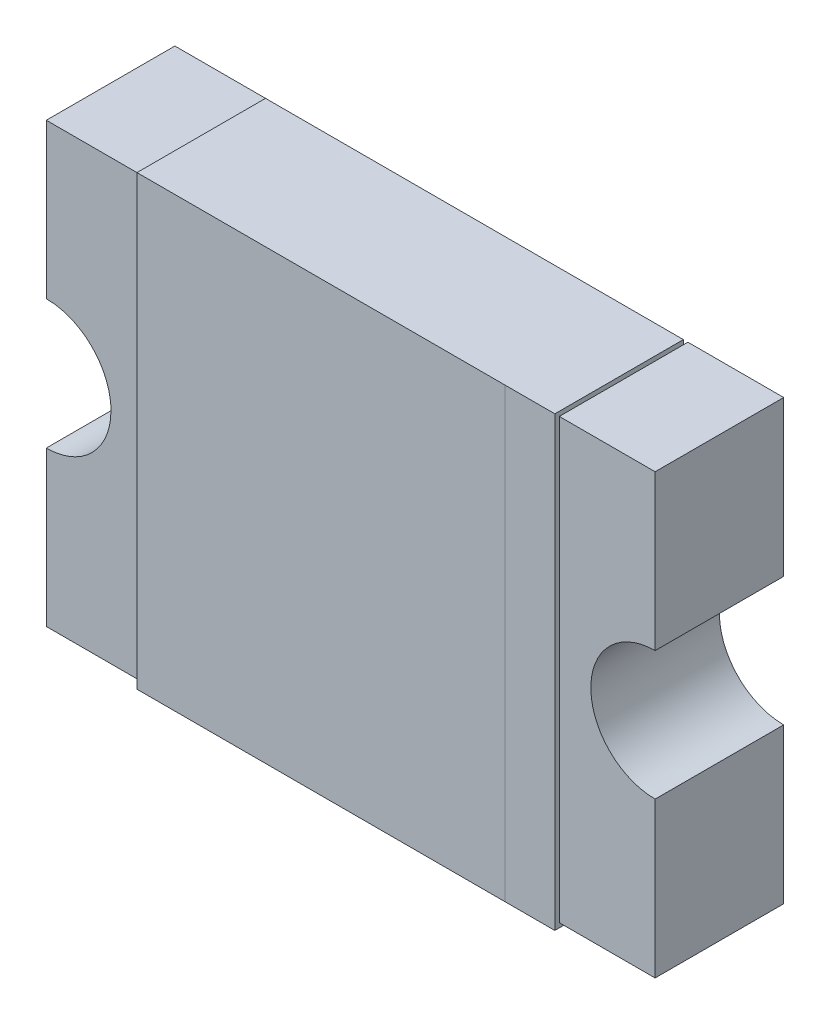
ISO-10303-21;
HEADER;
FILE_DESCRIPTION(('STEP AP214'),'2;1');
FILE_NAME('part.step','',(''),(''),'','','');
FILE_SCHEMA(('AUTOMOTIVE_DESIGN { 1 0 10303 214 1 1 1 1 }'));
ENDSEC;
DATA;
#1=APPLICATION_CONTEXT('core data for automotive mechanical design processes');
#2=APPLICATION_PROTOCOL_DEFINITION('international standard','automotive_design',2000,#1);
#3=PRODUCT_CONTEXT('',#1,'mechanical');
#4=PRODUCT('Part','Part','',(#3));
#5=PRODUCT_RELATED_PRODUCT_CATEGORY('part','',(#4));
#6=PRODUCT_DEFINITION_FORMATION('','',#4);
#7=PRODUCT_DEFINITION_CONTEXT('part definition',#1,'design');
#8=PRODUCT_DEFINITION('design','',#6,#7);
#9=PRODUCT_DEFINITION_SHAPE('','',#8);
#10=(LENGTH_UNIT() NAMED_UNIT(*) SI_UNIT(.MILLI.,.METRE.));
#11=(NAMED_UNIT(*) PLANE_ANGLE_UNIT() SI_UNIT($,.RADIAN.));
#12=(NAMED_UNIT(*) SI_UNIT($,.STERADIAN.) SOLID_ANGLE_UNIT());
#13=UNCERTAINTY_MEASURE_WITH_UNIT(LENGTH_MEASURE(1.E-05),#10,'distance_accuracy_value','');
#14=(GEOMETRIC_REPRESENTATION_CONTEXT(3) GLOBAL_UNCERTAINTY_ASSIGNED_CONTEXT((#13)) GLOBAL_UNIT_ASSIGNED_CONTEXT((#10,
#11,#12)) REPRESENTATION_CONTEXT('',''));
#15=CARTESIAN_POINT('',(0.,0.,0.));
#16=DIRECTION('',(0.,0.,1.));
#17=DIRECTION('',(1.,0.,0.));
#18=AXIS2_PLACEMENT_3D('',#15,#16,#17);
#19=CARTESIAN_POINT('',(-2.365,-1.705,1.));
#20=DIRECTION('',(0.,0.,1.));
#21=DIRECTION('',(1.,0.,0.));
#22=AXIS2_PLACEMENT_3D('',#19,#20,#21);
#23=PLANE('',#22);
#24=DIRECTION('',(0.,1.,0.));
#25=VECTOR('',#24,1.);
#26=CARTESIAN_POINT('',(2.37,-1.705,1.));
#27=LINE('',#26,#25);
#28=CARTESIAN_POINT('',(2.37,0.499999999999999,1.));
#29=VERTEX_POINT('',#28);
#30=CARTESIAN_POINT('',(2.37,1.705,1.));
#31=VERTEX_POINT('',#30);
#32=EDGE_CURVE('E161',#29,#31,#27,.T.);
#33=ORIENTED_EDGE('',*,*,#32,.T.);
#34=DIRECTION('',(1.,0.,0.));
#35=VECTOR('',#34,1.);
#36=CARTESIAN_POINT('',(-2.365,1.705,1.));
#37=LINE('',#36,#35);
#38=CARTESIAN_POINT('',(1.625,1.705,1.));
#39=VERTEX_POINT('',#38);
#40=EDGE_CURVE('E158',#31,#39,#37,.F.);
#41=ORIENTED_EDGE('',*,*,#40,.T.);
#42=DIRECTION('',(0.,-1.,0.));
#43=VECTOR('',#42,1.);
#44=CARTESIAN_POINT('',(1.625,1.705,1.));
#45=LINE('',#44,#43);
#46=CARTESIAN_POINT('',(1.625,-1.705,1.));
#47=VERTEX_POINT('',#46);
#48=EDGE_CURVE('E150',#39,#47,#45,.T.);
#49=ORIENTED_EDGE('',*,*,#48,.T.);
#50=DIRECTION('',(1.,0.,0.));
#51=VECTOR('',#50,1.);
#52=CARTESIAN_POINT('',(-2.365,-1.705,1.));
#53=LINE('',#52,#51);
#54=CARTESIAN_POINT('',(2.37,-1.705,1.));
#55=VERTEX_POINT('',#54);
#56=EDGE_CURVE('E134',#47,#55,#53,.T.);
#57=ORIENTED_EDGE('',*,*,#56,.T.);
#58=DIRECTION('',(0.,1.,0.));
#59=VECTOR('',#58,1.);
#60=CARTESIAN_POINT('',(2.37,-1.705,1.));
#61=LINE('',#60,#59);
#62=CARTESIAN_POINT('',(2.37,-0.500000000000001,1.));
#63=VERTEX_POINT('',#62);
#64=EDGE_CURVE('E123',#55,#63,#61,.T.);
#65=ORIENTED_EDGE('',*,*,#64,.T.);
#66=CARTESIAN_POINT('',(2.37,-0.500000000000001,1.));
#67=CARTESIAN_POINT('',(2.27438228657088,-0.499797074817794,1.));
#68=CARTESIAN_POINT('',(2.18595264521906,-0.464894150531217,1.));
#69=CARTESIAN_POINT('',(2.09012168443612,-0.427069946820945,1.));
#70=CARTESIAN_POINT('',(2.01644660940673,-0.353553390593275,1.));
#71=CARTESIAN_POINT('',(1.94351752679599,-0.280781221711928,1.));
#72=CARTESIAN_POINT('',(1.90510584946879,-0.184047354780938,1.));
#73=CARTESIAN_POINT('',(1.87010175667304,-0.0958949623274634,1.));
#74=CARTESIAN_POINT('',(1.87,0.,1.));
#75=CARTESIAN_POINT('',(1.86989935366217,0.0948485881711915,1.));
#76=CARTESIAN_POINT('',(1.90510584946879,0.184047354780935,1.));
#77=CARTESIAN_POINT('',(1.94293005317902,0.279878315563891,1.));
#78=CARTESIAN_POINT('',(2.01644660940673,0.353553390593272,1.));
#79=CARTESIAN_POINT('',(2.08921877828823,0.426482473204124,1.));
#80=CARTESIAN_POINT('',(2.18595264521906,0.464894150531214,1.));
#81=CARTESIAN_POINT('',(2.27384740170316,0.499795939655639,1.));
#82=CARTESIAN_POINT('',(2.37,0.499999999999999,1.));
#83=B_SPLINE_CURVE_WITH_KNOTS('',2,(#66,#67,#68,#69,#70,#71,#72,#73,#74,#75,#76,#77,#78,#79,#80,
#81,#82),.UNSPECIFIED.,.F.,.F.,(3,2,2,2,2,2,2,2,3),(0.,0.125,0.25,0.375,0.5,0.625,0.75,0.875,
1.),.UNSPECIFIED.);
#84=EDGE_CURVE('E133',#63,#29,#83,.T.);
#85=ORIENTED_EDGE('',*,*,#84,.T.);
#86=EDGE_LOOP('',(#33,#41,#49,#57,#65,#85));
#87=FACE_BOUND('',#86,.T.);
#88=ADVANCED_FACE('F17',(#87),#23,.T.);
#89=CARTESIAN_POINT('',(-2.365,-1.705,1.));
#90=DIRECTION('',(0.,0.,1.));
#91=DIRECTION('',(1.,0.,0.));
#92=AXIS2_PLACEMENT_3D('',#89,#90,#91);
#93=PLANE('',#92);
#94=DIRECTION('',(0.,1.,0.));
#95=VECTOR('',#94,1.);
#96=CARTESIAN_POINT('',(-2.365,1.705,1.));
#97=LINE('',#96,#95);
#98=CARTESIAN_POINT('',(-2.365,-0.502851750543757,1.));
#99=VERTEX_POINT('',#98);
#100=CARTESIAN_POINT('',(-2.365,-1.705,1.));
#101=VERTEX_POINT('',#100);
#102=EDGE_CURVE('E224',#99,#101,#97,.F.);
#103=ORIENTED_EDGE('',*,*,#102,.T.);
#104=DIRECTION('',(1.,0.,0.));
#105=VECTOR('',#104,1.);
#106=CARTESIAN_POINT('',(-2.365,-1.705,1.));
#107=LINE('',#106,#105);
#108=CARTESIAN_POINT('',(-1.625,-1.705,1.));
#109=VERTEX_POINT('',#108);
#110=EDGE_CURVE('E521',#101,#109,#107,.T.);
#111=ORIENTED_EDGE('',*,*,#110,.T.);
#112=DIRECTION('',(0.,1.,0.));
#113=VECTOR('',#112,1.);
#114=CARTESIAN_POINT('',(-1.625,1.705,1.));
#115=LINE('',#114,#113);
#116=CARTESIAN_POINT('',(-1.625,1.705,1.));
#117=VERTEX_POINT('',#116);
#118=EDGE_CURVE('E176',#109,#117,#115,.T.);
#119=ORIENTED_EDGE('',*,*,#118,.T.);
#120=DIRECTION('',(1.,0.,0.));
#121=VECTOR('',#120,1.);
#122=CARTESIAN_POINT('',(-2.365,1.705,1.));
#123=LINE('',#122,#121);
#124=CARTESIAN_POINT('',(-2.365,1.705,1.));
#125=VERTEX_POINT('',#124);
#126=EDGE_CURVE('E160',#117,#125,#123,.F.);
#127=ORIENTED_EDGE('',*,*,#126,.T.);
#128=DIRECTION('',(0.,1.,0.));
#129=VECTOR('',#128,1.);
#130=CARTESIAN_POINT('',(-2.365,1.705,1.));
#131=LINE('',#130,#129);
#132=CARTESIAN_POINT('',(-2.365,0.502851750543758,1.));
#133=VERTEX_POINT('',#132);
#134=EDGE_CURVE('E453',#125,#133,#131,.F.);
#135=ORIENTED_EDGE('',*,*,#134,.T.);
#136=CARTESIAN_POINT('',(-2.365,0.502851750543758,1.));
#137=CARTESIAN_POINT('',(-2.26883834751611,0.502648828859451,1.));
#138=CARTESIAN_POINT('',(-2.17990293093092,0.46754567482435,1.));
#139=CARTESIAN_POINT('',(-2.08352281969069,0.429504070920183,1.));
#140=CARTESIAN_POINT('',(-2.00943011725898,0.355569882741018,1.));
#141=CARTESIAN_POINT('',(-1.93608340269938,0.282380086464229,1.));
#142=CARTESIAN_POINT('',(-1.89745432517565,0.185097069069084,1.));
#143=CARTESIAN_POINT('',(-1.86235229986514,0.0966965387486382,1.));
#144=CARTESIAN_POINT('',(-1.86214824945624,0.,1.));
#145=B_SPLINE_CURVE_WITH_KNOTS('',2,(#136,#137,#138,#139,#140,#141,#142,#143,#144),
.UNSPECIFIED.,.F.,.F.,(3,2,2,2,3),(0.,0.25,0.5,0.75,1.),.UNSPECIFIED.);
#146=CARTESIAN_POINT('',(-1.86214824945624,0.,1.));
#147=VERTEX_POINT('',#146);
#148=EDGE_CURVE('E502',#133,#147,#145,.T.);
#149=ORIENTED_EDGE('',*,*,#148,.T.);
#150=CARTESIAN_POINT('',(-1.86214824945624,0.,1.));
#151=CARTESIAN_POINT('',(-1.86235117114055,-0.0961616524839028,1.));
#152=CARTESIAN_POINT('',(-1.89745432517565,-0.185097069069084,1.));
#153=CARTESIAN_POINT('',(-1.93549592907983,-0.281477180309321,1.));
#154=CARTESIAN_POINT('',(-2.00943011725898,-0.355569882741017,1.));
#155=CARTESIAN_POINT('',(-2.08261991353579,-0.428916597300633,1.));
#156=CARTESIAN_POINT('',(-2.17990293093092,-0.467545674824349,1.));
#157=CARTESIAN_POINT('',(-2.26830346125138,-0.502647700134861,1.));
#158=CARTESIAN_POINT('',(-2.365,-0.502851750543758,1.));
#159=B_SPLINE_CURVE_WITH_KNOTS('',2,(#150,#151,#152,#153,#154,#155,#156,#157,#158),
.UNSPECIFIED.,.F.,.F.,(3,2,2,2,3),(0.,0.25,0.5,0.75,1.),.UNSPECIFIED.);
#160=EDGE_CURVE('E237',#147,#99,#159,.T.);
#161=ORIENTED_EDGE('',*,*,#160,.T.);
#162=EDGE_LOOP('',(#103,#111,#119,#127,#135,#149,#161));
#163=FACE_BOUND('',#162,.T.);
#164=ADVANCED_FACE('F508',(#163),#93,.T.);
#165=CARTESIAN_POINT('',(1.625,1.705,1.035));
#166=DIRECTION('',(-1.,0.,0.));
#167=DIRECTION('',(0.,-1.,0.));
#168=AXIS2_PLACEMENT_3D('',#165,#166,#167);
#169=PLANE('',#168);
#170=DIRECTION('',(0.,1.,0.));
#171=VECTOR('',#170,1.);
#172=CARTESIAN_POINT('',(1.625,-1.74,1.0349));
#173=LINE('',#172,#171);
#174=CARTESIAN_POINT('',(1.625,1.74,1.0349));
#175=VERTEX_POINT('',#174);
#176=CARTESIAN_POINT('',(1.625,-1.74,1.0349));
#177=VERTEX_POINT('',#176);
#178=EDGE_CURVE('E242',#175,#177,#173,.F.);
#179=ORIENTED_EDGE('',*,*,#178,.T.);
#180=DIRECTION('',(0.,0.,1.));
#181=VECTOR('',#180,1.);
#182=CARTESIAN_POINT('',(1.625,-1.74,1.035));
#183=LINE('',#182,#181);
#184=CARTESIAN_POINT('',(1.625,-1.74,0.0350000000000001));
#185=VERTEX_POINT('',#184);
#186=EDGE_CURVE('E463',#185,#177,#183,.T.);
#187=ORIENTED_EDGE('',*,*,#186,.F.);
#188=DIRECTION('',(0.,-1.,0.));
#189=VECTOR('',#188,1.);
#190=CARTESIAN_POINT('',(1.625,1.705,0.0350000000000001));
#191=LINE('',#190,#189);
#192=CARTESIAN_POINT('',(1.625,-1.705,0.0350000000000001));
#193=VERTEX_POINT('',#192);
#194=EDGE_CURVE('E471',#193,#185,#191,.T.);
#195=ORIENTED_EDGE('',*,*,#194,.F.);
#196=DIRECTION('',(0.,0.,1.));
#197=VECTOR('',#196,1.);
#198=CARTESIAN_POINT('',(1.625,-1.705,1.035));
#199=LINE('',#198,#197);
#200=EDGE_CURVE('E598',#47,#193,#199,.F.);
#201=ORIENTED_EDGE('',*,*,#200,.F.);
#202=ORIENTED_EDGE('',*,*,#48,.F.);
#203=DIRECTION('',(0.,0.,1.));
#204=VECTOR('',#203,1.);
#205=CARTESIAN_POINT('',(1.625,1.705,1.035));
#206=LINE('',#205,#204);
#207=CARTESIAN_POINT('',(1.625,1.705,0.0349999999999999));
#208=VERTEX_POINT('',#207);
#209=EDGE_CURVE('E164',#208,#39,#206,.T.);
#210=ORIENTED_EDGE('',*,*,#209,.F.);
#211=DIRECTION('',(0.,-1.,0.));
#212=VECTOR('',#211,1.);
#213=CARTESIAN_POINT('',(1.625,1.705,0.0349999999999999));
#214=LINE('',#213,#212);
#215=CARTESIAN_POINT('',(1.625,1.74,0.0349999999999999));
#216=VERTEX_POINT('',#215);
#217=EDGE_CURVE('E166',#216,#208,#214,.T.);
#218=ORIENTED_EDGE('',*,*,#217,.F.);
#219=DIRECTION('',(0.,0.,1.));
#220=VECTOR('',#219,1.);
#221=CARTESIAN_POINT('',(1.625,1.74,1.035));
#222=LINE('',#221,#220);
#223=EDGE_CURVE('E455',#175,#216,#222,.F.);
#224=ORIENTED_EDGE('',*,*,#223,.F.);
#225=EDGE_LOOP('',(#179,#187,#195,#201,#202,#210,#218,#224));
#226=FACE_BOUND('',#225,.T.);
#227=ADVANCED_FACE('F516',(#226),#169,.F.);
#228=CARTESIAN_POINT('',(-2.365,1.705,1.));
#229=DIRECTION('',(1.,0.,0.));
#230=DIRECTION('',(0.,1.,0.));
#231=AXIS2_PLACEMENT_3D('',#228,#229,#230);
#232=PLANE('',#231);
#233=DIRECTION('',(0.,0.,1.));
#234=VECTOR('',#233,1.);
#235=CARTESIAN_POINT('',(-2.365,0.502851750543758,0.));
#236=LINE('',#235,#234);
#237=CARTESIAN_POINT('',(-2.365,0.502851750543758,0.));
#238=VERTEX_POINT('',#237);
#239=EDGE_CURVE('E259',#238,#133,#236,.T.);
#240=ORIENTED_EDGE('',*,*,#239,.T.);
#241=ORIENTED_EDGE('',*,*,#134,.F.);
#242=DIRECTION('',(0.,0.,-1.));
#243=VECTOR('',#242,1.);
#244=CARTESIAN_POINT('',(-2.365,1.705,1.));
#245=LINE('',#244,#243);
#246=CARTESIAN_POINT('',(-2.365,1.705,0.));
#247=VERTEX_POINT('',#246);
#248=EDGE_CURVE('E438',#125,#247,#245,.T.);
#249=ORIENTED_EDGE('',*,*,#248,.T.);
#250=DIRECTION('',(0.,1.,0.));
#251=VECTOR('',#250,1.);
#252=CARTESIAN_POINT('',(-2.365,-1.705,0.));
#253=LINE('',#252,#251);
#254=EDGE_CURVE('E295',#247,#238,#253,.F.);
#255=ORIENTED_EDGE('',*,*,#254,.T.);
#256=EDGE_LOOP('',(#240,#241,#249,#255));
#257=FACE_BOUND('',#256,.T.);
#258=ADVANCED_FACE('F271',(#257),#232,.F.);
#259=CARTESIAN_POINT('',(-2.365,0.,0.));
#260=DIRECTION('',(0.,0.,1.));
#261=DIRECTION('',(1.,0.,0.));
#262=AXIS2_PLACEMENT_3D('',#259,#260,#261);
#263=CYLINDRICAL_SURFACE('',#262,0.502851750543758);
#264=CARTESIAN_POINT('',(-2.365,0.,0.));
#265=DIRECTION('',(0.,0.,-1.));
#266=DIRECTION('',(1.,0.,0.));
#267=AXIS2_PLACEMENT_3D('',#264,#265,#266);
#268=CIRCLE('',#267,0.502851750543758);
#269=CARTESIAN_POINT('',(-1.86214824945624,0.,0.));
#270=VERTEX_POINT('',#269);
#271=CARTESIAN_POINT('',(-2.365,-0.502851750543757,0.));
#272=VERTEX_POINT('',#271);
#273=EDGE_CURVE('E254',#270,#272,#268,.T.);
#274=ORIENTED_EDGE('',*,*,#273,.T.);
#275=DIRECTION('',(0.,0.,1.));
#276=VECTOR('',#275,1.);
#277=CARTESIAN_POINT('',(-2.365,-0.502851750543756,1.));
#278=LINE('',#277,#276);
#279=EDGE_CURVE('E234',#272,#99,#278,.T.);
#280=ORIENTED_EDGE('',*,*,#279,.T.);
#281=ORIENTED_EDGE('',*,*,#160,.F.);
#282=ORIENTED_EDGE('',*,*,#148,.F.);
#283=ORIENTED_EDGE('',*,*,#239,.F.);
#284=CARTESIAN_POINT('',(-2.365,0.,0.));
#285=DIRECTION('',(0.,0.,-1.));
#286=DIRECTION('',(0.,1.,0.));
#287=AXIS2_PLACEMENT_3D('',#284,#285,#286);
#288=CIRCLE('',#287,0.502851750543758);
#289=EDGE_CURVE('E290',#238,#270,#288,.T.);
#290=ORIENTED_EDGE('',*,*,#289,.T.);
#291=EDGE_LOOP('',(#274,#280,#281,#282,#283,#290));
#292=FACE_BOUND('',#291,.T.);
#293=ADVANCED_FACE('F261',(#292),#263,.F.);
#294=CARTESIAN_POINT('',(-2.365,1.705,1.));
#295=DIRECTION('',(1.,0.,0.));
#296=DIRECTION('',(0.,1.,0.));
#297=AXIS2_PLACEMENT_3D('',#294,#295,#296);
#298=PLANE('',#297);
#299=ORIENTED_EDGE('',*,*,#279,.F.);
#300=DIRECTION('',(0.,1.,0.));
#301=VECTOR('',#300,1.);
#302=CARTESIAN_POINT('',(-2.365,-1.705,0.));
#303=LINE('',#302,#301);
#304=CARTESIAN_POINT('',(-2.365,-1.705,0.));
#305=VERTEX_POINT('',#304);
#306=EDGE_CURVE('E248',#272,#305,#303,.F.);
#307=ORIENTED_EDGE('',*,*,#306,.T.);
#308=DIRECTION('',(0.,0.,1.));
#309=VECTOR('',#308,1.);
#310=CARTESIAN_POINT('',(-2.365,-1.705,1.));
#311=LINE('',#310,#309);
#312=EDGE_CURVE('E186',#305,#101,#311,.T.);
#313=ORIENTED_EDGE('',*,*,#312,.T.);
#314=ORIENTED_EDGE('',*,*,#102,.F.);
#315=EDGE_LOOP('',(#299,#307,#313,#314));
#316=FACE_BOUND('',#315,.T.);
#317=ADVANCED_FACE('F270',(#316),#298,.F.);
#318=CARTESIAN_POINT('',(2.37,1.705,1.));
#319=DIRECTION('',(-1.,0.,0.));
#320=DIRECTION('',(0.,-1.,0.));
#321=AXIS2_PLACEMENT_3D('',#318,#319,#320);
#322=PLANE('',#321);
#323=ORIENTED_EDGE('',*,*,#64,.F.);
#324=DIRECTION('',(0.,0.,1.));
#325=VECTOR('',#324,1.);
#326=CARTESIAN_POINT('',(2.37,-1.705,1.));
#327=LINE('',#326,#325);
#328=CARTESIAN_POINT('',(2.37,-1.705,0.));
#329=VERTEX_POINT('',#328);
#330=EDGE_CURVE('E126',#55,#329,#327,.F.);
#331=ORIENTED_EDGE('',*,*,#330,.T.);
#332=DIRECTION('',(0.,1.,0.));
#333=VECTOR('',#332,1.);
#334=CARTESIAN_POINT('',(2.37,-1.705,0.));
#335=LINE('',#334,#333);
#336=CARTESIAN_POINT('',(2.37,-0.500000000000001,0.));
#337=VERTEX_POINT('',#336);
#338=EDGE_CURVE('E144',#329,#337,#335,.T.);
#339=ORIENTED_EDGE('',*,*,#338,.T.);
#340=DIRECTION('',(0.,0.,1.));
#341=VECTOR('',#340,1.);
#342=CARTESIAN_POINT('',(2.37,-0.500000000000001,0.));
#343=LINE('',#342,#341);
#344=EDGE_CURVE('E129',#337,#63,#343,.T.);
#345=ORIENTED_EDGE('',*,*,#344,.T.);
#346=EDGE_LOOP('',(#323,#331,#339,#345));
#347=FACE_BOUND('',#346,.T.);
#348=ADVANCED_FACE('F125',(#347),#322,.F.);
#349=CARTESIAN_POINT('',(2.37,0.,0.));
#350=DIRECTION('',(0.,0.,1.));
#351=DIRECTION('',(0.,-1.,0.));
#352=AXIS2_PLACEMENT_3D('',#349,#350,#351);
#353=CYLINDRICAL_SURFACE('',#352,0.5);
#354=CARTESIAN_POINT('',(2.37,0.,0.));
#355=DIRECTION('',(0.,0.,-1.));
#356=DIRECTION('',(0.,-1.,0.));
#357=AXIS2_PLACEMENT_3D('',#354,#355,#356);
#358=CIRCLE('',#357,0.5);
#359=CARTESIAN_POINT('',(2.37,0.499999999999999,0.));
#360=VERTEX_POINT('',#359);
#361=EDGE_CURVE('E398',#337,#360,#358,.T.);
#362=ORIENTED_EDGE('',*,*,#361,.T.);
#363=DIRECTION('',(0.,0.,1.));
#364=VECTOR('',#363,1.);
#365=CARTESIAN_POINT('',(2.37,0.499999999999999,1.));
#366=LINE('',#365,#364);
#367=EDGE_CURVE('E179',#360,#29,#366,.T.);
#368=ORIENTED_EDGE('',*,*,#367,.T.);
#369=ORIENTED_EDGE('',*,*,#84,.F.);
#370=ORIENTED_EDGE('',*,*,#344,.F.);
#371=EDGE_LOOP('',(#362,#368,#369,#370));
#372=FACE_BOUND('',#371,.T.);
#373=ADVANCED_FACE('F198',(#372),#353,.F.);
#374=CARTESIAN_POINT('',(2.37,1.705,1.));
#375=DIRECTION('',(-1.,0.,0.));
#376=DIRECTION('',(0.,-1.,0.));
#377=AXIS2_PLACEMENT_3D('',#374,#375,#376);
#378=PLANE('',#377);
#379=DIRECTION('',(0.,1.,0.));
#380=VECTOR('',#379,1.);
#381=CARTESIAN_POINT('',(2.37,-1.705,0.));
#382=LINE('',#381,#380);
#383=CARTESIAN_POINT('',(2.37,1.705,0.));
#384=VERTEX_POINT('',#383);
#385=EDGE_CURVE('E229',#360,#384,#382,.T.);
#386=ORIENTED_EDGE('',*,*,#385,.T.);
#387=DIRECTION('',(0.,0.,-1.));
#388=VECTOR('',#387,1.);
#389=CARTESIAN_POINT('',(2.37,1.705,1.));
#390=LINE('',#389,#388);
#391=EDGE_CURVE('E372',#384,#31,#390,.F.);
#392=ORIENTED_EDGE('',*,*,#391,.T.);
#393=ORIENTED_EDGE('',*,*,#32,.F.);
#394=ORIENTED_EDGE('',*,*,#367,.F.);
#395=EDGE_LOOP('',(#386,#392,#393,#394));
#396=FACE_BOUND('',#395,.T.);
#397=ADVANCED_FACE('F208',(#396),#378,.F.);
#398=CARTESIAN_POINT('',(-1.625,1.705,1.035));
#399=DIRECTION('',(1.,0.,0.));
#400=DIRECTION('',(0.,1.,0.));
#401=AXIS2_PLACEMENT_3D('',#398,#399,#400);
#402=PLANE('',#401);
#403=DIRECTION('',(0.,0.,1.));
#404=VECTOR('',#403,1.);
#405=CARTESIAN_POINT('',(-1.625,-1.74,1.035));
#406=LINE('',#405,#404);
#407=CARTESIAN_POINT('',(-1.625,-1.74,1.035));
#408=VERTEX_POINT('',#407);
#409=CARTESIAN_POINT('',(-1.625,-1.74,0.0350000000000001));
#410=VERTEX_POINT('',#409);
#411=EDGE_CURVE('E357',#408,#410,#406,.F.);
#412=ORIENTED_EDGE('',*,*,#411,.F.);
#413=DIRECTION('',(0.,1.,0.));
#414=VECTOR('',#413,1.);
#415=CARTESIAN_POINT('',(-1.625,1.705,1.035));
#416=LINE('',#415,#414);
#417=CARTESIAN_POINT('',(-1.625,1.74,1.035));
#418=VERTEX_POINT('',#417);
#419=EDGE_CURVE('E376',#408,#418,#416,.T.);
#420=ORIENTED_EDGE('',*,*,#419,.T.);
#421=DIRECTION('',(0.,0.,1.));
#422=VECTOR('',#421,1.);
#423=CARTESIAN_POINT('',(-1.625,1.74,1.035));
#424=LINE('',#423,#422);
#425=CARTESIAN_POINT('',(-1.625,1.74,0.0349999999999999));
#426=VERTEX_POINT('',#425);
#427=EDGE_CURVE('E360',#426,#418,#424,.T.);
#428=ORIENTED_EDGE('',*,*,#427,.F.);
#429=DIRECTION('',(0.,1.,0.));
#430=VECTOR('',#429,1.);
#431=CARTESIAN_POINT('',(-1.625,1.705,0.0349999999999999));
#432=LINE('',#431,#430);
#433=CARTESIAN_POINT('',(-1.625,1.705,0.0349999999999999));
#434=VERTEX_POINT('',#433);
#435=EDGE_CURVE('E38',#434,#426,#432,.T.);
#436=ORIENTED_EDGE('',*,*,#435,.F.);
#437=DIRECTION('',(0.,0.,-1.));
#438=VECTOR('',#437,1.);
#439=CARTESIAN_POINT('',(-1.625,1.705,1.));
#440=LINE('',#439,#438);
#441=EDGE_CURVE('E185',#434,#117,#440,.F.);
#442=ORIENTED_EDGE('',*,*,#441,.T.);
#443=ORIENTED_EDGE('',*,*,#118,.F.);
#444=DIRECTION('',(0.,0.,1.));
#445=VECTOR('',#444,1.);
#446=CARTESIAN_POINT('',(-1.625,-1.705,1.));
#447=LINE('',#446,#445);
#448=CARTESIAN_POINT('',(-1.625,-1.705,0.0350000000000001));
#449=VERTEX_POINT('',#448);
#450=EDGE_CURVE('E182',#109,#449,#447,.F.);
#451=ORIENTED_EDGE('',*,*,#450,.T.);
#452=DIRECTION('',(0.,1.,0.));
#453=VECTOR('',#452,1.);
#454=CARTESIAN_POINT('',(-1.625,1.705,0.0350000000000001));
#455=LINE('',#454,#453);
#456=EDGE_CURVE('E351',#410,#449,#455,.T.);
#457=ORIENTED_EDGE('',*,*,#456,.F.);
#458=EDGE_LOOP('',(#412,#420,#428,#436,#442,#443,#451,#457));
#459=FACE_BOUND('',#458,.T.);
#460=ADVANCED_FACE('F333',(#459),#402,.F.);
#461=CARTESIAN_POINT('',(1.625,-1.74,1.0349));
#462=DIRECTION('',(0.,0.,-1.));
#463=DIRECTION('',(-1.,0.,0.));
#464=AXIS2_PLACEMENT_3D('',#461,#462,#463);
#465=PLANE('',#464);
#466=DIRECTION('',(-1.,0.,0.));
#467=VECTOR('',#466,1.);
#468=CARTESIAN_POINT('',(1.625,1.74,1.0349));
#469=LINE('',#468,#467);
#470=CARTESIAN_POINT('',(1.23686777791931,1.74,1.03495));
#471=VERTEX_POINT('',#470);
#472=EDGE_CURVE('E350',#471,#175,#469,.F.);
#473=ORIENTED_EDGE('',*,*,#472,.F.);
#474=CARTESIAN_POINT('',(1.23686777791931,1.74,1.0349));
#475=DIRECTION('',(0.,-1.,0.));
#476=VECTOR('',#475,1.);
#477=LINE('',#474,#476);
#478=CARTESIAN_POINT('',(1.23686777791931,-1.74,1.03495));
#479=VERTEX_POINT('',#478);
#480=EDGE_CURVE('E382',#471,#479,#477,.T.);
#481=ORIENTED_EDGE('',*,*,#480,.T.);
#482=DIRECTION('',(-1.,0.,0.));
#483=VECTOR('',#482,1.);
#484=CARTESIAN_POINT('',(1.625,-1.74,1.0349));
#485=LINE('',#484,#483);
#486=EDGE_CURVE('E342',#177,#479,#485,.T.);
#487=ORIENTED_EDGE('',*,*,#486,.F.);
#488=ORIENTED_EDGE('',*,*,#178,.F.);
#489=EDGE_LOOP('',(#473,#481,#487,#488));
#490=FACE_BOUND('',#489,.T.);
#491=ADVANCED_FACE('F329',(#490),#465,.F.);
#492=CARTESIAN_POINT('',(-2.365,-1.705,1.));
#493=DIRECTION('',(0.,1.,0.));
#494=DIRECTION('',(0.,0.,1.));
#495=AXIS2_PLACEMENT_3D('',#492,#493,#494);
#496=PLANE('',#495);
#497=ORIENTED_EDGE('',*,*,#110,.F.);
#498=ORIENTED_EDGE('',*,*,#312,.F.);
#499=DIRECTION('',(1.,0.,0.));
#500=VECTOR('',#499,1.);
#501=CARTESIAN_POINT('',(-2.365,-1.705,0.));
#502=LINE('',#501,#500);
#503=CARTESIAN_POINT('',(-1.625,-1.705,0.));
#504=VERTEX_POINT('',#503);
#505=EDGE_CURVE('E245',#305,#504,#502,.T.);
#506=ORIENTED_EDGE('',*,*,#505,.T.);
#507=DIRECTION('',(0.,0.,1.));
#508=VECTOR('',#507,1.);
#509=CARTESIAN_POINT('',(-1.625,-1.705,0.0350000000000001));
#510=LINE('',#509,#508);
#511=EDGE_CURVE('E388',#504,#449,#510,.T.);
#512=ORIENTED_EDGE('',*,*,#511,.T.);
#513=ORIENTED_EDGE('',*,*,#450,.F.);
#514=EDGE_LOOP('',(#497,#498,#506,#512,#513));
#515=FACE_BOUND('',#514,.T.);
#516=ADVANCED_FACE('F325',(#515),#496,.F.);
#517=CARTESIAN_POINT('',(-2.365,1.705,1.));
#518=DIRECTION('',(0.,-1.,0.));
#519=DIRECTION('',(0.,0.,-1.));
#520=AXIS2_PLACEMENT_3D('',#517,#518,#519);
#521=PLANE('',#520);
#522=DIRECTION('',(1.,0.,0.));
#523=VECTOR('',#522,1.);
#524=CARTESIAN_POINT('',(-2.365,1.705,0.));
#525=LINE('',#524,#523);
#526=CARTESIAN_POINT('',(-1.625,1.705,0.));
#527=VERTEX_POINT('',#526);
#528=EDGE_CURVE('E145',#527,#247,#525,.F.);
#529=ORIENTED_EDGE('',*,*,#528,.T.);
#530=ORIENTED_EDGE('',*,*,#248,.F.);
#531=ORIENTED_EDGE('',*,*,#126,.F.);
#532=ORIENTED_EDGE('',*,*,#441,.F.);
#533=DIRECTION('',(0.,0.,1.));
#534=VECTOR('',#533,1.);
#535=CARTESIAN_POINT('',(-1.625,1.705,0.0350000000000001));
#536=LINE('',#535,#534);
#537=EDGE_CURVE('E490',#434,#527,#536,.F.);
#538=ORIENTED_EDGE('',*,*,#537,.T.);
#539=EDGE_LOOP('',(#529,#530,#531,#532,#538));
#540=FACE_BOUND('',#539,.T.);
#541=ADVANCED_FACE('F320',(#540),#521,.F.);
#542=CARTESIAN_POINT('',(-2.365,-1.705,0.));
#543=DIRECTION('',(0.,0.,1.));
#544=DIRECTION('',(1.,0.,0.));
#545=AXIS2_PLACEMENT_3D('',#542,#543,#544);
#546=PLANE('',#545);
#547=DIRECTION('',(0.,1.,0.));
#548=VECTOR('',#547,1.);
#549=CARTESIAN_POINT('',(-1.625,-1.74,0.));
#550=LINE('',#549,#548);
#551=EDGE_CURVE('E493',#527,#504,#550,.F.);
#552=ORIENTED_EDGE('',*,*,#551,.T.);
#553=ORIENTED_EDGE('',*,*,#505,.F.);
#554=ORIENTED_EDGE('',*,*,#306,.F.);
#555=ORIENTED_EDGE('',*,*,#273,.F.);
#556=ORIENTED_EDGE('',*,*,#289,.F.);
#557=ORIENTED_EDGE('',*,*,#254,.F.);
#558=ORIENTED_EDGE('',*,*,#528,.F.);
#559=EDGE_LOOP('',(#552,#553,#554,#555,#556,#557,#558));
#560=FACE_BOUND('',#559,.T.);
#561=ADVANCED_FACE('F299',(#560),#546,.F.);
#562=CARTESIAN_POINT('',(-2.365,-1.705,1.));
#563=DIRECTION('',(0.,1.,0.));
#564=DIRECTION('',(0.,0.,1.));
#565=AXIS2_PLACEMENT_3D('',#562,#563,#564);
#566=PLANE('',#565);
#567=DIRECTION('',(1.,0.,0.));
#568=VECTOR('',#567,1.);
#569=CARTESIAN_POINT('',(-2.365,-1.705,0.));
#570=LINE('',#569,#568);
#571=CARTESIAN_POINT('',(1.625,-1.705,0.));
#572=VERTEX_POINT('',#571);
#573=EDGE_CURVE('E142',#572,#329,#570,.T.);
#574=ORIENTED_EDGE('',*,*,#573,.T.);
#575=ORIENTED_EDGE('',*,*,#330,.F.);
#576=ORIENTED_EDGE('',*,*,#56,.F.);
#577=ORIENTED_EDGE('',*,*,#200,.T.);
#578=DIRECTION('',(0.,0.,-1.));
#579=VECTOR('',#578,1.);
#580=CARTESIAN_POINT('',(1.625,-1.705,0.0350000000000001));
#581=LINE('',#580,#579);
#582=EDGE_CURVE('E543',#193,#572,#581,.T.);
#583=ORIENTED_EDGE('',*,*,#582,.T.);
#584=EDGE_LOOP('',(#574,#575,#576,#577,#583));
#585=FACE_BOUND('',#584,.T.);
#586=ADVANCED_FACE('F138',(#585),#566,.F.);
#587=CARTESIAN_POINT('',(-2.365,-1.705,0.));
#588=DIRECTION('',(0.,0.,1.));
#589=DIRECTION('',(1.,0.,0.));
#590=AXIS2_PLACEMENT_3D('',#587,#588,#589);
#591=PLANE('',#590);
#592=DIRECTION('',(0.,1.,0.));
#593=VECTOR('',#592,1.);
#594=CARTESIAN_POINT('',(1.625,-1.74,0.));
#595=LINE('',#594,#593);
#596=CARTESIAN_POINT('',(1.625,1.705,0.));
#597=VERTEX_POINT('',#596);
#598=EDGE_CURVE('E173',#572,#597,#595,.T.);
#599=ORIENTED_EDGE('',*,*,#598,.T.);
#600=DIRECTION('',(1.,0.,0.));
#601=VECTOR('',#600,1.);
#602=CARTESIAN_POINT('',(-2.365,1.705,0.));
#603=LINE('',#602,#601);
#604=EDGE_CURVE('E228',#597,#384,#603,.T.);
#605=ORIENTED_EDGE('',*,*,#604,.T.);
#606=ORIENTED_EDGE('',*,*,#385,.F.);
#607=ORIENTED_EDGE('',*,*,#361,.F.);
#608=ORIENTED_EDGE('',*,*,#338,.F.);
#609=ORIENTED_EDGE('',*,*,#573,.F.);
#610=EDGE_LOOP('',(#599,#605,#606,#607,#608,#609));
#611=FACE_BOUND('',#610,.T.);
#612=ADVANCED_FACE('F403',(#611),#591,.F.);
#613=CARTESIAN_POINT('',(-2.365,1.705,1.));
#614=DIRECTION('',(0.,-1.,0.));
#615=DIRECTION('',(0.,0.,-1.));
#616=AXIS2_PLACEMENT_3D('',#613,#614,#615);
#617=PLANE('',#616);
#618=ORIENTED_EDGE('',*,*,#40,.F.);
#619=ORIENTED_EDGE('',*,*,#391,.F.);
#620=ORIENTED_EDGE('',*,*,#604,.F.);
#621=DIRECTION('',(0.,0.,-1.));
#622=VECTOR('',#621,1.);
#623=CARTESIAN_POINT('',(1.625,1.705,0.0350000000000001));
#624=LINE('',#623,#622);
#625=EDGE_CURVE('E169',#597,#208,#624,.F.);
#626=ORIENTED_EDGE('',*,*,#625,.T.);
#627=ORIENTED_EDGE('',*,*,#209,.T.);
#628=EDGE_LOOP('',(#618,#619,#620,#626,#627));
#629=FACE_BOUND('',#628,.T.);
#630=ADVANCED_FACE('F412',(#629),#617,.F.);
#631=CARTESIAN_POINT('',(1.625,1.705,1.035));
#632=DIRECTION('',(0.,0.,-1.));
#633=DIRECTION('',(-1.,0.,0.));
#634=AXIS2_PLACEMENT_3D('',#631,#632,#633);
#635=PLANE('',#634);
#636=ORIENTED_EDGE('',*,*,#480,.F.);
#637=DIRECTION('',(1.,0.,0.));
#638=VECTOR('',#637,1.);
#639=CARTESIAN_POINT('',(-1.625,1.74,1.035));
#640=LINE('',#639,#638);
#641=EDGE_CURVE('E542',#471,#418,#640,.F.);
#642=ORIENTED_EDGE('',*,*,#641,.T.);
#643=ORIENTED_EDGE('',*,*,#419,.F.);
#644=DIRECTION('',(1.,0.,0.));
#645=VECTOR('',#644,1.);
#646=CARTESIAN_POINT('',(-1.625,-1.74,1.035));
#647=LINE('',#646,#645);
#648=EDGE_CURVE('E172',#479,#408,#647,.F.);
#649=ORIENTED_EDGE('',*,*,#648,.F.);
#650=EDGE_LOOP('',(#636,#642,#643,#649));
#651=FACE_BOUND('',#650,.T.);
#652=ADVANCED_FACE('F415',(#651),#635,.F.);
#653=CARTESIAN_POINT('',(-1.625,-1.74,0.0350000000000001));
#654=DIRECTION('',(-1.,0.,0.));
#655=DIRECTION('',(0.,0.,1.));
#656=AXIS2_PLACEMENT_3D('',#653,#654,#655);
#657=PLANE('',#656);
#658=ORIENTED_EDGE('',*,*,#537,.F.);
#659=DIRECTION('',(0.,1.,0.));
#660=VECTOR('',#659,1.);
#661=CARTESIAN_POINT('',(-1.625,1.74,0.0349999999999999));
#662=LINE('',#661,#660);
#663=EDGE_CURVE('E482',#449,#434,#662,.T.);
#664=ORIENTED_EDGE('',*,*,#663,.F.);
#665=ORIENTED_EDGE('',*,*,#511,.F.);
#666=ORIENTED_EDGE('',*,*,#551,.F.);
#667=EDGE_LOOP('',(#658,#664,#665,#666));
#668=FACE_BOUND('',#667,.T.);
#669=ADVANCED_FACE('F420',(#668),#657,.F.);
#670=CARTESIAN_POINT('',(-1.625,1.74,0.));
#671=DIRECTION('',(0.,-1.,0.));
#672=DIRECTION('',(0.,0.,-1.));
#673=AXIS2_PLACEMENT_3D('',#670,#671,#672);
#674=PLANE('',#673);
#675=ORIENTED_EDGE('',*,*,#472,.T.);
#676=ORIENTED_EDGE('',*,*,#223,.T.);
#677=DIRECTION('',(1.,0.,0.));
#678=VECTOR('',#677,1.);
#679=CARTESIAN_POINT('',(-1.625,1.74,0.0349999999999999));
#680=LINE('',#679,#678);
#681=EDGE_CURVE('E479',#426,#216,#680,.T.);
#682=ORIENTED_EDGE('',*,*,#681,.F.);
#683=ORIENTED_EDGE('',*,*,#427,.T.);
#684=ORIENTED_EDGE('',*,*,#641,.F.);
#685=EDGE_LOOP('',(#675,#676,#682,#683,#684));
#686=FACE_BOUND('',#685,.T.);
#687=ADVANCED_FACE('F589',(#686),#674,.F.);
#688=CARTESIAN_POINT('',(1.625,-1.74,0.0350000000000001));
#689=DIRECTION('',(1.,0.,0.));
#690=DIRECTION('',(0.,0.,-1.));
#691=AXIS2_PLACEMENT_3D('',#688,#689,#690);
#692=PLANE('',#691);
#693=ORIENTED_EDGE('',*,*,#625,.F.);
#694=ORIENTED_EDGE('',*,*,#598,.F.);
#695=ORIENTED_EDGE('',*,*,#582,.F.);
#696=DIRECTION('',(0.,1.,0.));
#697=VECTOR('',#696,1.);
#698=CARTESIAN_POINT('',(1.625,1.74,0.0349999999999999));
#699=LINE('',#698,#697);
#700=EDGE_CURVE('E29',#208,#193,#699,.F.);
#701=ORIENTED_EDGE('',*,*,#700,.F.);
#702=EDGE_LOOP('',(#693,#694,#695,#701));
#703=FACE_BOUND('',#702,.T.);
#704=ADVANCED_FACE('F594',(#703),#692,.F.);
#705=CARTESIAN_POINT('',(-1.625,-1.74,0.));
#706=DIRECTION('',(0.,-1.,0.));
#707=DIRECTION('',(0.,0.,-1.));
#708=AXIS2_PLACEMENT_3D('',#705,#706,#707);
#709=PLANE('',#708);
#710=ORIENTED_EDGE('',*,*,#186,.T.);
#711=ORIENTED_EDGE('',*,*,#486,.T.);
#712=ORIENTED_EDGE('',*,*,#648,.T.);
#713=ORIENTED_EDGE('',*,*,#411,.T.);
#714=DIRECTION('',(1.,0.,0.));
#715=VECTOR('',#714,1.);
#716=CARTESIAN_POINT('',(-1.625,-1.74,0.0350000000000001));
#717=LINE('',#716,#715);
#718=EDGE_CURVE('E11',#185,#410,#717,.F.);
#719=ORIENTED_EDGE('',*,*,#718,.F.);
#720=EDGE_LOOP('',(#710,#711,#712,#713,#719));
#721=FACE_BOUND('',#720,.T.);
#722=ADVANCED_FACE('F554',(#721),#709,.T.);
#723=CARTESIAN_POINT('',(-1.625,1.74,0.0349999999999999));
#724=DIRECTION('',(0.,0.,-1.));
#725=DIRECTION('',(0.,1.,0.));
#726=AXIS2_PLACEMENT_3D('',#723,#724,#725);
#727=PLANE('',#726);
#728=ORIENTED_EDGE('',*,*,#194,.T.);
#729=ORIENTED_EDGE('',*,*,#718,.T.);
#730=ORIENTED_EDGE('',*,*,#456,.T.);
#731=ORIENTED_EDGE('',*,*,#663,.T.);
#732=ORIENTED_EDGE('',*,*,#435,.T.);
#733=ORIENTED_EDGE('',*,*,#681,.T.);
#734=ORIENTED_EDGE('',*,*,#217,.T.);
#735=ORIENTED_EDGE('',*,*,#700,.T.);
#736=EDGE_LOOP('',(#728,#729,#730,#731,#732,#733,#734,#735));
#737=FACE_BOUND('',#736,.T.);
#738=ADVANCED_FACE('F581',(#737),#727,.T.);
#739=CLOSED_SHELL('',(#88,#164,#227,#258,#293,#317,#348,#373,#397,#460,#491,#516,#541,#561,#586,
#612,#630,#652,#669,#687,#704,#722,#738));
#740=MANIFOLD_SOLID_BREP('B1',#739);
#741=ADVANCED_BREP_SHAPE_REPRESENTATION('',(#18,#740),#14);
#742=SHAPE_DEFINITION_REPRESENTATION(#9,#741);
ENDSEC;
END-ISO-10303-21;
